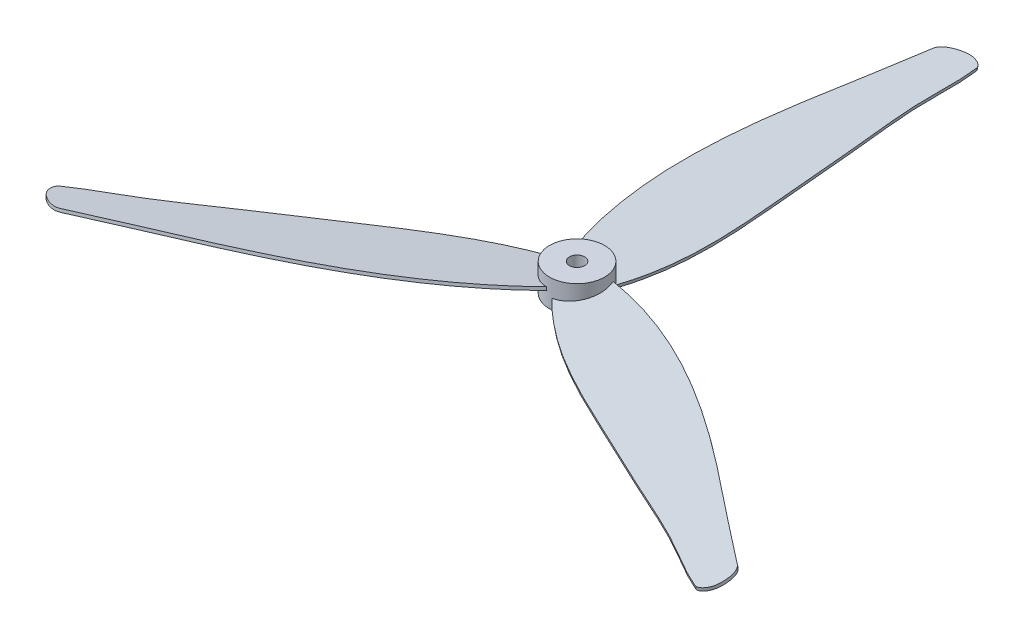
ISO-10303-21;
HEADER;
FILE_DESCRIPTION(('STEP AP214'),'2;1');
FILE_NAME('part.step','',(''),(''),'','','');
FILE_SCHEMA(('AUTOMOTIVE_DESIGN { 1 0 10303 214 1 1 1 1 }'));
ENDSEC;
DATA;
#1=APPLICATION_CONTEXT('core data for automotive mechanical design processes');
#2=APPLICATION_PROTOCOL_DEFINITION('international standard','automotive_design',2000,#1);
#3=PRODUCT_CONTEXT('',#1,'mechanical');
#4=PRODUCT('Part','Part','',(#3));
#5=PRODUCT_RELATED_PRODUCT_CATEGORY('part','',(#4));
#6=PRODUCT_DEFINITION_FORMATION('','',#4);
#7=PRODUCT_DEFINITION_CONTEXT('part definition',#1,'design');
#8=PRODUCT_DEFINITION('design','',#6,#7);
#9=PRODUCT_DEFINITION_SHAPE('','',#8);
#10=(LENGTH_UNIT() NAMED_UNIT(*) SI_UNIT(.MILLI.,.METRE.));
#11=(NAMED_UNIT(*) PLANE_ANGLE_UNIT() SI_UNIT($,.RADIAN.));
#12=(NAMED_UNIT(*) SI_UNIT($,.STERADIAN.) SOLID_ANGLE_UNIT());
#13=UNCERTAINTY_MEASURE_WITH_UNIT(LENGTH_MEASURE(1.E-05),#10,'distance_accuracy_value','');
#14=(GEOMETRIC_REPRESENTATION_CONTEXT(3) GLOBAL_UNCERTAINTY_ASSIGNED_CONTEXT((#13)) GLOBAL_UNIT_ASSIGNED_CONTEXT((#10,
#11,#12)) REPRESENTATION_CONTEXT('',''));
#15=CARTESIAN_POINT('',(0.,0.,0.));
#16=DIRECTION('',(0.,0.,1.));
#17=DIRECTION('',(1.,0.,0.));
#18=AXIS2_PLACEMENT_3D('',#15,#16,#17);
#19=CARTESIAN_POINT('',(0.,9.,0.));
#20=DIRECTION('',(0.,-1.,0.));
#21=DIRECTION('',(0.,0.,-1.));
#22=AXIS2_PLACEMENT_3D('',#19,#20,#21);
#23=CYLINDRICAL_SURFACE('',#22,9.);
#24=CARTESIAN_POINT('',(0.,3.54362794025801,0.));
#25=DIRECTION('',(0.156434465040231,0.987688340595138,0.));
#26=DIRECTION('',(0.987688340595138,-0.156434465040231,0.));
#27=AXIS2_PLACEMENT_3D('',#24,#25,#26);
#28=ELLIPSE('',#27,9.11218613209203,9.);
#29=CARTESIAN_POINT('',(7.30430784711758,2.38673922993417,-5.25804972157326));
#30=VERTEX_POINT('',#29);
#31=CARTESIAN_POINT('',(-7.28372938367546,4.69725734216683,-5.2865192958489));
#32=VERTEX_POINT('',#31);
#33=EDGE_CURVE('E97',#30,#32,#28,.T.);
#34=ORIENTED_EDGE('',*,*,#33,.F.);
#35=CARTESIAN_POINT('',(7.41620379576395,3.38148177852124,-5.09901179246494));
#36=CARTESIAN_POINT('',(7.39770465756707,3.21573761419823,-5.12591312980971));
#37=CARTESIAN_POINT('',(7.37913042608144,3.04997031965447,-5.15261695924113));
#38=CARTESIAN_POINT('',(7.34183177653266,2.71838947012545,-5.20562960227724));
#39=CARTESIAN_POINT('',(7.3231073584695,2.55257591514019,-5.23193841588193));
#40=CARTESIAN_POINT('',(7.30430784711759,2.38673922993417,-5.25804972157327));
#41=B_SPLINE_CURVE_WITH_KNOTS('',3,(#35,#36,#37,#38,#39,#40),.UNSPECIFIED.,.F.,.F.,(4,2,4),(0.,
0.506785983130427,1.01357196626085),.UNSPECIFIED.);
#42=CARTESIAN_POINT('',(7.41620379576395,3.38148177852124,-5.09901179246494));
#43=VERTEX_POINT('',#42);
#44=EDGE_CURVE('E164',#43,#30,#41,.T.);
#45=ORIENTED_EDGE('',*,*,#44,.F.);
#46=CARTESIAN_POINT('',(0.,4.55609306604602,0.));
#47=DIRECTION('',(0.156434465040231,0.987688340595138,0.));
#48=DIRECTION('',(0.987688340595138,-0.156434465040231,0.));
#49=AXIS2_PLACEMENT_3D('',#46,#47,#48);
#50=ELLIPSE('',#49,9.11218613209203,9.);
#51=CARTESIAN_POINT('',(-7.17614569150034,5.69268288508163,-5.43166024474664));
#52=VERTEX_POINT('',#51);
#53=EDGE_CURVE('E184',#43,#52,#50,.T.);
#54=ORIENTED_EDGE('',*,*,#53,.T.);
#55=CARTESIAN_POINT('',(-7.28372938367546,4.69725734216683,-5.28651929584885));
#56=CARTESIAN_POINT('',(-7.26593509251969,4.86312914673476,-5.31103307316615));
#57=CARTESIAN_POINT('',(-7.24807263926054,5.02901717759495,-5.33538504089962));
#58=CARTESIAN_POINT('',(-7.2122114085355,5.36082569189989,-5.38376535719889));
#59=CARTESIAN_POINT('',(-7.1942126310696,5.52674617534463,-5.40779370576468));
#60=CARTESIAN_POINT('',(-7.17614569150033,5.69268288508163,-5.43166024474664));
#61=B_SPLINE_CURVE_WITH_KNOTS('',3,(#55,#56,#57,#58,#59,#60),.UNSPECIFIED.,.F.,.F.,(4,2,4),(0.,
0.505844164901021,1.01168832980204),.UNSPECIFIED.);
#62=EDGE_CURVE('E171',#32,#52,#61,.T.);
#63=ORIENTED_EDGE('',*,*,#62,.F.);
#64=EDGE_LOOP('',(#34,#45,#54,#63));
#65=FACE_BOUND('',#64,.T.);
#66=CARTESIAN_POINT('',(0.,0.,0.));
#67=DIRECTION('',(0.,1.,0.));
#68=DIRECTION('',(0.,0.,1.));
#69=AXIS2_PLACEMENT_3D('',#66,#67,#68);
#70=CIRCLE('',#69,9.);
#71=CARTESIAN_POINT('',(0.,0.,9.));
#72=VERTEX_POINT('',#71);
#73=EDGE_CURVE('E230',#72,#72,#70,.T.);
#74=ORIENTED_EDGE('',*,*,#73,.T.);
#75=EDGE_LOOP('',(#74));
#76=FACE_BOUND('',#75,.T.);
#77=CARTESIAN_POINT('',(0.,9.,0.));
#78=DIRECTION('',(0.,1.,0.));
#79=DIRECTION('',(0.,0.,1.));
#80=AXIS2_PLACEMENT_3D('',#77,#78,#79);
#81=CIRCLE('',#80,9.);
#82=CARTESIAN_POINT('',(0.,9.,9.));
#83=VERTEX_POINT('',#82);
#84=EDGE_CURVE('E233',#83,#83,#81,.T.);
#85=ORIENTED_EDGE('',*,*,#84,.F.);
#86=EDGE_LOOP('',(#85));
#87=FACE_BOUND('',#86,.T.);
#88=CARTESIAN_POINT('',(0.,3.54362794025801,0.));
#89=DIRECTION('',(-0.0782172325201163,0.987688340595138,0.135476220752269));
#90=DIRECTION('',(-0.493844170297573,-0.156434465040231,0.855363193977084));
#91=AXIS2_PLACEMENT_3D('',#88,#89,#90);
#92=ELLIPSE('',#91,9.11218613209203,9.);
#93=CARTESIAN_POINT('',(0.901450709685308,2.38673922993417,8.95474101345248));
#94=VERTEX_POINT('',#93);
#95=CARTESIAN_POINT('',(8.22012469963952,4.69725734216683,-3.66463503262963));
#96=VERTEX_POINT('',#95);
#97=EDGE_CURVE('E185',#94,#96,#92,.T.);
#98=ORIENTED_EDGE('',*,*,#97,.F.);
#99=CARTESIAN_POINT('',(0.707771848589028,3.38148177852124,8.97212678300662));
#100=CARTESIAN_POINT('',(0.740318659223825,3.21573761419823,8.9695567280524));
#101=CARTESIAN_POINT('',(0.77273196963258,3.04997031965448,8.96682288644578));
#102=CARTESIAN_POINT('',(0.837291589998006,2.71838947012545,8.96102762992774));
#103=CARTESIAN_POINT('',(0.869437899954678,2.55257591514019,8.95796621501631));
#104=CARTESIAN_POINT('',(0.901450709685308,2.38673922993417,8.95474101345248));
#105=B_SPLINE_CURVE_WITH_KNOTS('',3,(#99,#100,#101,#102,#103,#104),.UNSPECIFIED.,.F.,.F.,(4,2,
4),(0.,0.506785983130426,1.01357196626085),.UNSPECIFIED.);
#106=CARTESIAN_POINT('',(0.707771848589048,3.38148177852124,8.97212678300663));
#107=VERTEX_POINT('',#106);
#108=EDGE_CURVE('E196',#107,#94,#105,.T.);
#109=ORIENTED_EDGE('',*,*,#108,.F.);
#110=CARTESIAN_POINT('',(0.,4.55609306604602,0.));
#111=DIRECTION('',(-0.0782172325201163,0.987688340595138,0.135476220752269));
#112=DIRECTION('',(-0.493844170297573,-0.156434465040231,0.855363193977084));
#113=AXIS2_PLACEMENT_3D('',#110,#111,#112);
#114=ELLIPSE('',#113,9.11218613209203,9.);
#115=CARTESIAN_POINT('',(8.29202860242678,5.69268288508163,-3.49889434772418));
#116=VERTEX_POINT('',#115);
#117=EDGE_CURVE('E236',#107,#116,#114,.T.);
#118=ORIENTED_EDGE('',*,*,#117,.T.);
#119=CARTESIAN_POINT('',(8.22012469963947,4.69725734216683,-3.66463503262966));
#120=CARTESIAN_POINT('',(8.23245710796109,4.86312914673476,-3.63696783578777));
#121=CARTESIAN_POINT('',(8.24461530402083,5.02901717759496,-3.6093225136247));
#122=CARTESIAN_POINT('',(8.2685832716166,5.36082569189989,-3.55407561865621));
#123=CARTESIAN_POINT('',(8.28039304315262,5.52674617534463,-3.52647404585078));
#124=CARTESIAN_POINT('',(8.29202860242678,5.69268288508163,-3.49889434772418));
#125=B_SPLINE_CURVE_WITH_KNOTS('',3,(#119,#120,#121,#122,#123,#124),.UNSPECIFIED.,.F.,.F.,(4,2,
4),(0.,0.505844164901022,1.01168832980204),.UNSPECIFIED.);
#126=EDGE_CURVE('E186',#96,#116,#125,.T.);
#127=ORIENTED_EDGE('',*,*,#126,.F.);
#128=EDGE_LOOP('',(#98,#109,#118,#127));
#129=FACE_BOUND('',#128,.T.);
#130=CARTESIAN_POINT('',(0.,3.54362794025801,0.));
#131=DIRECTION('',(-0.0782172325201162,0.987688340595138,-0.135476220752269));
#132=DIRECTION('',(-0.493844170297573,-0.156434465040231,-0.855363193977084));
#133=AXIS2_PLACEMENT_3D('',#130,#131,#132);
#134=ELLIPSE('',#133,9.11218613209203,9.);
#135=CARTESIAN_POINT('',(-8.20575855680295,2.38673922993417,-3.69669129187918));
#136=VERTEX_POINT('',#135);
#137=CARTESIAN_POINT('',(-0.936395315964,4.69725734216683,8.95115432847857));
#138=VERTEX_POINT('',#137);
#139=EDGE_CURVE('E11',#136,#138,#134,.T.);
#140=ORIENTED_EDGE('',*,*,#139,.F.);
#141=CARTESIAN_POINT('',(-8.12397564435305,3.38148177852123,-3.87311499054165));
#142=CARTESIAN_POINT('',(-8.13802331679097,3.21573761419823,-3.84364359824265));
#143=CARTESIAN_POINT('',(-8.15186239571408,3.04997031965447,-3.81420592720461));
#144=CARTESIAN_POINT('',(-8.17912336653072,2.71838947012545,-3.75539802765046));
#145=CARTESIAN_POINT('',(-8.19254525842424,2.55257591514019,-3.72602779913434));
#146=CARTESIAN_POINT('',(-8.20575855680295,2.38673922993418,-3.69669129187918));
#147=B_SPLINE_CURVE_WITH_KNOTS('',3,(#141,#142,#143,#144,#145,#146),.UNSPECIFIED.,.F.,.F.,(4,2,
4),(0.,0.50678598313042,1.01357196626084),.UNSPECIFIED.);
#148=CARTESIAN_POINT('',(-8.12397564435306,3.38148177852124,-3.87311499054165));
#149=VERTEX_POINT('',#148);
#150=EDGE_CURVE('E96',#149,#136,#147,.T.);
#151=ORIENTED_EDGE('',*,*,#150,.F.);
#152=CARTESIAN_POINT('',(0.,4.55609306604602,0.));
#153=DIRECTION('',(-0.0782172325201162,0.987688340595138,-0.135476220752269));
#154=DIRECTION('',(-0.493844170297573,-0.156434465040231,-0.855363193977084));
#155=AXIS2_PLACEMENT_3D('',#152,#153,#154);
#156=ELLIPSE('',#155,9.11218613209203,9.);
#157=CARTESIAN_POINT('',(-1.11588291092639,5.69268288508163,8.93055459247086));
#158=VERTEX_POINT('',#157);
#159=EDGE_CURVE('E91',#149,#158,#156,.T.);
#160=ORIENTED_EDGE('',*,*,#159,.T.);
#161=CARTESIAN_POINT('',(-0.936395315963954,4.69725734216683,8.95115432847855));
#162=CARTESIAN_POINT('',(-0.966522015441339,4.86312914673476,8.94800090895396));
#163=CARTESIAN_POINT('',(-0.996542664760233,5.02901717759495,8.94470755452437));
#164=CARTESIAN_POINT('',(-1.05637186308104,5.36082569189988,8.93784097585514));
#165=CARTESIAN_POINT('',(-1.08618041208296,5.52674617534462,8.93426775161551));
#166=CARTESIAN_POINT('',(-1.11588291092638,5.69268288508162,8.93055459247086));
#167=B_SPLINE_CURVE_WITH_KNOTS('',3,(#161,#162,#163,#164,#165,#166),.UNSPECIFIED.,.F.,.F.,(4,2,
4),(0.,0.505844164901016,1.01168832980203),.UNSPECIFIED.);
#168=EDGE_CURVE('E49',#138,#158,#167,.T.);
#169=ORIENTED_EDGE('',*,*,#168,.F.);
#170=EDGE_LOOP('',(#140,#151,#160,#169));
#171=FACE_BOUND('',#170,.T.);
#172=ADVANCED_FACE('F41',(#65,#76,#87,#129,#171),#23,.T.);
#173=CARTESIAN_POINT('',(0.,9.,0.));
#174=DIRECTION('',(0.,1.,0.));
#175=DIRECTION('',(0.,0.,1.));
#176=AXIS2_PLACEMENT_3D('',#173,#174,#175);
#177=PLANE('',#176);
#178=ORIENTED_EDGE('',*,*,#84,.T.);
#179=EDGE_LOOP('',(#178));
#180=FACE_BOUND('',#179,.T.);
#181=CARTESIAN_POINT('',(0.,9.,0.));
#182=DIRECTION('',(0.,1.,0.));
#183=DIRECTION('',(0.,0.,1.));
#184=AXIS2_PLACEMENT_3D('',#181,#182,#183);
#185=CIRCLE('',#184,2.5);
#186=CARTESIAN_POINT('',(0.,9.,2.5));
#187=VERTEX_POINT('',#186);
#188=EDGE_CURVE('E224',#187,#187,#185,.T.);
#189=ORIENTED_EDGE('',*,*,#188,.F.);
#190=EDGE_LOOP('',(#189));
#191=FACE_BOUND('',#190,.T.);
#192=ADVANCED_FACE('F246',(#180,#191),#177,.T.);
#193=CARTESIAN_POINT('',(0.,0.,0.));
#194=DIRECTION('',(0.,1.,0.));
#195=DIRECTION('',(0.,0.,1.));
#196=AXIS2_PLACEMENT_3D('',#193,#194,#195);
#197=PLANE('',#196);
#198=ORIENTED_EDGE('',*,*,#73,.F.);
#199=EDGE_LOOP('',(#198));
#200=FACE_BOUND('',#199,.T.);
#201=CARTESIAN_POINT('',(0.,0.,0.));
#202=DIRECTION('',(0.,1.,0.));
#203=DIRECTION('',(0.,0.,1.));
#204=AXIS2_PLACEMENT_3D('',#201,#202,#203);
#205=CIRCLE('',#204,2.5);
#206=CARTESIAN_POINT('',(0.,0.,2.5));
#207=VERTEX_POINT('',#206);
#208=EDGE_CURVE('E216',#207,#207,#205,.T.);
#209=ORIENTED_EDGE('',*,*,#208,.T.);
#210=EDGE_LOOP('',(#209));
#211=FACE_BOUND('',#210,.T.);
#212=ADVANCED_FACE('F251',(#200,#211),#197,.F.);
#213=CARTESIAN_POINT('',(0.,9.,0.));
#214=DIRECTION('',(0.,-1.,0.));
#215=DIRECTION('',(0.,0.,-1.));
#216=AXIS2_PLACEMENT_3D('',#213,#214,#215);
#217=CYLINDRICAL_SURFACE('',#216,2.5);
#218=ORIENTED_EDGE('',*,*,#188,.T.);
#219=EDGE_LOOP('',(#218));
#220=FACE_BOUND('',#219,.T.);
#221=ORIENTED_EDGE('',*,*,#208,.F.);
#222=EDGE_LOOP('',(#221));
#223=FACE_BOUND('',#222,.T.);
#224=ADVANCED_FACE('F206',(#220,#223),#217,.F.);
#225=CARTESIAN_POINT('',(6.07128886437522,4.58317983054747,-4.07358476355836));
#226=CARTESIAN_POINT('',(30.0274191154173,5.88967505732956,0.232500129810801));
#227=CARTESIAN_POINT('',(65.3611569346111,5.90057996757105,20.5529410073428));
#228=CARTESIAN_POINT('',(95.6678257611402,4.77268380270435,46.2734226874995));
#229=CARTESIAN_POINT('',(110.338679272948,4.43565398162164,57.2007572182211));
#230=CARTESIAN_POINT('',(110.888971991819,3.8453898245611,61.8217851437842));
#231=CARTESIAN_POINT('',(109.606010039389,3.14844611510895,66.1621294437965));
#232=CARTESIAN_POINT('',(106.812806514418,2.73477342422366,67.5653501932813));
#233=CARTESIAN_POINT('',(105.316603334889,2.7101153798658,66.8812861666804));
#234=CARTESIAN_POINT('',(99.7791919174203,2.61715864183006,64.3619605745815));
#235=CARTESIAN_POINT('',(88.5197573784138,2.72077298483617,57.1059234454856));
#236=CARTESIAN_POINT('',(70.2021946473294,2.3700309638207,49.0873556658917));
#237=CARTESIAN_POINT('',(39.3058016566439,2.0131199885944,33.8513715628341));
#238=CARTESIAN_POINT('',(14.3923305409287,1.52115674879017,23.0542265062131));
#239=CARTESIAN_POINT('',(0.244924495635226,2.42772974256338,8.27685441144336));
#240=B_SPLINE_CURVE_WITH_KNOTS('',3,(#225,#226,#227,#228,#229,#230,#231,#232,#233,#234,#235,
#236,#237,#238,#239),.UNSPECIFIED.,.F.,.F.,(4,1,1,1,1,1,1,1,1,1,1,1,4),(0.,0.28293344669307,
0.466482550178483,0.471857061893158,0.495005991949986,0.514382548074224,0.523354602147642,
0.526650828201052,0.53318720122455,0.595375397845292,0.68247325334402,0.76793576336452,1.),.UNSPECIFIED.);
#241=DIRECTION('',(-0.0782172325201162,0.987688340595138,0.135476220752268));
#242=VECTOR('',#241,1.);
#243=SURFACE_OF_LINEAR_EXTRUSION('',#240,#242);
#244=EDGE_CURVE('E210',#96,#94,#240,.T.);
#245=ORIENTED_EDGE('',*,*,#244,.F.);
#246=ORIENTED_EDGE('',*,*,#126,.T.);
#247=CARTESIAN_POINT('',(5.9930716318551,5.57086817114261,-3.93810854280609));
#248=CARTESIAN_POINT('',(29.9492018828972,6.8773633979247,0.367976350563069));
#249=CARTESIAN_POINT('',(65.2829397020909,6.88826830816618,20.6884172280951));
#250=CARTESIAN_POINT('',(95.58960852862,5.76037214329949,46.4088989082518));
#251=CARTESIAN_POINT('',(110.260462040428,5.42334232221677,57.3362334389734));
#252=CARTESIAN_POINT('',(110.810754759299,4.83307816515624,61.9572613645364));
#253=CARTESIAN_POINT('',(109.527792806869,4.13613445570409,66.2976056645488));
#254=CARTESIAN_POINT('',(106.734589281898,3.7224617648188,67.7008264140335));
#255=CARTESIAN_POINT('',(105.238386102369,3.69780372046094,67.0167623874327));
#256=CARTESIAN_POINT('',(99.7009746849001,3.6048469824252,64.4974367953338));
#257=CARTESIAN_POINT('',(88.4415401458937,3.70846132543131,57.2413996662378));
#258=CARTESIAN_POINT('',(70.1239774148093,3.35771930441584,49.222831886644));
#259=CARTESIAN_POINT('',(39.2275844241237,3.00080832918954,33.9868477835864));
#260=CARTESIAN_POINT('',(14.3141133084086,2.50884508938531,23.1897027269654));
#261=CARTESIAN_POINT('',(0.16670726311511,3.41541808315852,8.41233063219563));
#262=B_SPLINE_CURVE_WITH_KNOTS('',3,(#247,#248,#249,#250,#251,#252,#253,#254,#255,#256,#257,
#258,#259,#260,#261),.UNSPECIFIED.,.F.,.F.,(4,1,1,1,1,1,1,1,1,1,1,1,4),(0.,0.28293344669307,
0.466482550178483,0.471857061893158,0.495005991949986,0.514382548074224,0.523354602147642,
0.526650828201052,0.53318720122455,0.595375397845292,0.68247325334402,0.76793576336452,1.),.UNSPECIFIED.);
#263=EDGE_CURVE('E146',#116,#107,#262,.T.);
#264=ORIENTED_EDGE('',*,*,#263,.T.);
#265=ORIENTED_EDGE('',*,*,#108,.T.);
#266=EDGE_LOOP('',(#245,#246,#264,#265));
#267=FACE_BOUND('',#266,.T.);
#268=ADVANCED_FACE('F202',(#267),#243,.F.);
#269=CARTESIAN_POINT('',(110.275945295483,3.5873097675363,63.3493846772373));
#270=DIRECTION('',(-0.0782172325201163,0.987688340595138,0.135476220752269));
#271=DIRECTION('',(0.,-0.135892549420804,0.9907235815362));
#272=AXIS2_PLACEMENT_3D('',#269,#270,#271);
#273=PLANE('',#272);
#274=ORIENTED_EDGE('',*,*,#244,.T.);
#275=ORIENTED_EDGE('',*,*,#97,.T.);
#276=EDGE_LOOP('',(#274,#275));
#277=FACE_BOUND('',#276,.T.);
#278=ADVANCED_FACE('F160',(#277),#273,.F.);
#279=CARTESIAN_POINT('',(110.197728062963,4.57499810813144,63.4848608979895));
#280=DIRECTION('',(-0.0782172325201163,0.987688340595138,0.135476220752269));
#281=DIRECTION('',(0.,-0.135892549420804,0.9907235815362));
#282=AXIS2_PLACEMENT_3D('',#279,#280,#281);
#283=PLANE('',#282);
#284=ORIENTED_EDGE('',*,*,#117,.F.);
#285=ORIENTED_EDGE('',*,*,#263,.F.);
#286=EDGE_LOOP('',(#284,#285));
#287=FACE_BOUND('',#286,.T.);
#288=ADVANCED_FACE('F158',(#287),#283,.T.);
#289=CARTESIAN_POINT('',(-6.56347232189839,4.58317983054747,-3.22109800848331));
#290=CARTESIAN_POINT('',(-14.8123585389095,5.88967505732956,-26.1207578289392));
#291=CARTESIAN_POINT('',(-14.8812094324641,5.90057996757105,-66.8808928297859));
#292=CARTESIAN_POINT('',(-7.75995331314078,4.77268380270435,-105.98747877772));
#293=CARTESIAN_POINT('',(-5.63203076978911,4.43565398162164,-124.156477879507));
#294=CARTESIAN_POINT('',(-1.90524955408981,3.8453898245611,-126.943559316349));
#295=CARTESIAN_POINT('',(2.49507984710695,3.14844611510895,-128.002653823462));
#296=CARTESIAN_POINT('',(5.10690642576363,2.73477342422366,-126.285278987639));
#297=CARTESIAN_POINT('',(5.26259119067698,2.7101153798658,-124.647497011643));
#298=CARTESIAN_POINT('',(5.84949693624938,2.61715864183006,-118.59229525686));
#299=CARTESIAN_POINT('',(5.1953017211525,2.72077298483617,-105.213320349284));
#300=CARTESIAN_POINT('',(7.4097996875991,2.3700309638207,-85.3405617989531));
#301=CARTESIAN_POINT('',(9.66324689803829,2.0131199885944,-50.9655085321832));
#302=CARTESIAN_POINT('',(12.7693805485167,1.52115674879017,-23.9912371212135));
#303=CARTESIAN_POINT('',(7.04550393591762,2.42772974256338,-4.35053804095091));
#304=B_SPLINE_CURVE_WITH_KNOTS('',3,(#289,#290,#291,#292,#293,#294,#295,#296,#297,#298,#299,
#300,#301,#302,#303),.UNSPECIFIED.,.F.,.F.,(4,1,1,1,1,1,1,1,1,1,1,1,4),(0.,0.28293344669307,
0.466482550178483,0.471857061893158,0.495005991949986,0.514382548074224,0.523354602147642,
0.526650828201052,0.53318720122455,0.595375397845292,0.68247325334402,0.76793576336452,1.),.UNSPECIFIED.);
#305=DIRECTION('',(0.156434465040231,0.987688340595138,0.));
#306=VECTOR('',#305,1.);
#307=SURFACE_OF_LINEAR_EXTRUSION('',#304,#306);
#308=EDGE_CURVE('E137',#32,#30,#304,.T.);
#309=ORIENTED_EDGE('',*,*,#308,.F.);
#310=ORIENTED_EDGE('',*,*,#62,.T.);
#311=CARTESIAN_POINT('',(-6.40703785685816,5.57086817114261,-3.22109800848331));
#312=CARTESIAN_POINT('',(-14.6559240738692,6.8773633979247,-26.1207578289392));
#313=CARTESIAN_POINT('',(-14.7247749674238,6.88826830816618,-66.8808928297859));
#314=CARTESIAN_POINT('',(-7.60351884810055,5.76037214329949,-105.98747877772));
#315=CARTESIAN_POINT('',(-5.47559630474888,5.42334232221677,-124.156477879507));
#316=CARTESIAN_POINT('',(-1.74881508904958,4.83307816515624,-126.943559316349));
#317=CARTESIAN_POINT('',(2.65151431214718,4.13613445570409,-128.002653823462));
#318=CARTESIAN_POINT('',(5.26334089080386,3.7224617648188,-126.285278987639));
#319=CARTESIAN_POINT('',(5.41902565571722,3.69780372046094,-124.647497011643));
#320=CARTESIAN_POINT('',(6.00593140128962,3.6048469824252,-118.59229525686));
#321=CARTESIAN_POINT('',(5.35173618619274,3.70846132543131,-105.213320349284));
#322=CARTESIAN_POINT('',(7.56623415263933,3.35771930441584,-85.3405617989531));
#323=CARTESIAN_POINT('',(9.81968136307852,3.00080832918954,-50.9655085321832));
#324=CARTESIAN_POINT('',(12.9258150135569,2.50884508938531,-23.9912371212135));
#325=CARTESIAN_POINT('',(7.20193840095785,3.41541808315852,-4.35053804095091));
#326=B_SPLINE_CURVE_WITH_KNOTS('',3,(#311,#312,#313,#314,#315,#316,#317,#318,#319,#320,#321,
#322,#323,#324,#325),.UNSPECIFIED.,.F.,.F.,(4,1,1,1,1,1,1,1,1,1,1,1,4),(0.,0.28293344669307,
0.466482550178483,0.471857061893158,0.495005991949986,0.514382548074224,0.523354602147642,
0.526650828201052,0.53318720122455,0.595375397845292,0.68247325334402,0.76793576336452,1.),.UNSPECIFIED.);
#327=EDGE_CURVE('E62',#52,#43,#326,.T.);
#328=ORIENTED_EDGE('',*,*,#327,.T.);
#329=ORIENTED_EDGE('',*,*,#44,.T.);
#330=EDGE_LOOP('',(#309,#310,#328,#329));
#331=FACE_BOUND('',#330,.T.);
#332=ADVANCED_FACE('F154',(#331),#307,.F.);
#333=CARTESIAN_POINT('',(-0.275796203142048,3.5873097675363,-127.17646239085));
#334=DIRECTION('',(0.156434465040231,0.987688340595138,0.));
#335=DIRECTION('',(0.85799178973865,-0.135892549420804,-0.495361790768104));
#336=AXIS2_PLACEMENT_3D('',#333,#334,#335);
#337=PLANE('',#336);
#338=ORIENTED_EDGE('',*,*,#308,.T.);
#339=ORIENTED_EDGE('',*,*,#33,.T.);
#340=EDGE_LOOP('',(#338,#339));
#341=FACE_BOUND('',#340,.T.);
#342=ADVANCED_FACE('F125',(#341),#337,.F.);
#343=CARTESIAN_POINT('',(-0.119361738101816,4.57499810813144,-127.17646239085));
#344=DIRECTION('',(0.156434465040231,0.987688340595138,0.));
#345=DIRECTION('',(0.85799178973865,-0.135892549420804,-0.495361790768104));
#346=AXIS2_PLACEMENT_3D('',#343,#344,#345);
#347=PLANE('',#346);
#348=ORIENTED_EDGE('',*,*,#53,.F.);
#349=ORIENTED_EDGE('',*,*,#327,.F.);
#350=EDGE_LOOP('',(#348,#349));
#351=FACE_BOUND('',#350,.T.);
#352=ADVANCED_FACE('F123',(#351),#347,.T.);
#353=CARTESIAN_POINT('',(0.492183457523219,4.58317983054747,7.29468277204169));
#354=CARTESIAN_POINT('',(-15.2150605765078,5.88967505732956,25.8882576991286));
#355=CARTESIAN_POINT('',(-50.4799475021469,5.90057996757105,46.3279518224437));
#356=CARTESIAN_POINT('',(-87.9078724479993,4.77268380270435,59.7140560902217));
#357=CARTESIAN_POINT('',(-104.706648503159,4.43565398162164,66.9557206612871));
#358=CARTESIAN_POINT('',(-108.98372243773,3.8453898245611,65.1217741725657));
#359=CARTESIAN_POINT('',(-112.101089886496,3.14844611510895,61.8405243796661));
#360=CARTESIAN_POINT('',(-111.919712940182,2.73477342422366,58.7199287943587));
#361=CARTESIAN_POINT('',(-110.579194525566,2.7101153798658,57.7662108449635));
#362=CARTESIAN_POINT('',(-105.62868885367,2.61715864183006,54.2303346822791));
#363=CARTESIAN_POINT('',(-93.7150590995663,2.72077298483617,48.1073969037994));
#364=CARTESIAN_POINT('',(-77.6119943349286,2.3700309638207,36.2532061330621));
#365=CARTESIAN_POINT('',(-48.9690485546822,2.0131199885944,17.1141369693495));
#366=CARTESIAN_POINT('',(-27.1617110894455,1.52115674879017,0.93701061500056));
#367=CARTESIAN_POINT('',(-7.2904284315529,2.42772974256338,-3.92631637049242));
#368=B_SPLINE_CURVE_WITH_KNOTS('',3,(#353,#354,#355,#356,#357,#358,#359,#360,#361,#362,#363,
#364,#365,#366,#367),.UNSPECIFIED.,.F.,.F.,(4,1,1,1,1,1,1,1,1,1,1,1,4),(0.,0.28293344669307,
0.466482550178483,0.471857061893158,0.495005991949986,0.514382548074224,0.523354602147642,
0.526650828201052,0.53318720122455,0.595375397845292,0.68247325334402,0.76793576336452,1.),.UNSPECIFIED.);
#369=DIRECTION('',(-0.0782172325201162,0.987688340595138,-0.135476220752268));
#370=VECTOR('',#369,1.);
#371=SURFACE_OF_LINEAR_EXTRUSION('',#368,#370);
#372=EDGE_CURVE('E103',#138,#136,#368,.T.);
#373=ORIENTED_EDGE('',*,*,#372,.F.);
#374=ORIENTED_EDGE('',*,*,#168,.T.);
#375=CARTESIAN_POINT('',(0.413966225003103,5.57086817114261,7.15920655128942));
#376=CARTESIAN_POINT('',(-15.2932778090279,6.8773633979247,25.7527814783764));
#377=CARTESIAN_POINT('',(-50.558164734667,6.88826830816618,46.1924756016914));
#378=CARTESIAN_POINT('',(-87.9860896805194,5.76037214329949,59.5785798694695));
#379=CARTESIAN_POINT('',(-104.784865735679,5.42334232221677,66.8202444405348));
#380=CARTESIAN_POINT('',(-109.06193967025,4.83307816515624,64.9862979518134));
#381=CARTESIAN_POINT('',(-112.179307119016,4.13613445570409,61.7050481589139));
#382=CARTESIAN_POINT('',(-111.997930172702,3.7224617648188,58.5844525736064));
#383=CARTESIAN_POINT('',(-110.657411758086,3.69780372046094,57.6307346242112));
#384=CARTESIAN_POINT('',(-105.70690608619,3.6048469824252,54.0948584615268));
#385=CARTESIAN_POINT('',(-93.7932763320864,3.70846132543131,47.9719206830471));
#386=CARTESIAN_POINT('',(-77.6902115674487,3.35771930441584,36.1177299123098));
#387=CARTESIAN_POINT('',(-49.0472657872023,3.00080832918954,16.9786607485972));
#388=CARTESIAN_POINT('',(-27.2399283219656,2.50884508938531,0.801534394248291));
#389=CARTESIAN_POINT('',(-7.36864566407302,3.41541808315852,-4.06179259124468));
#390=B_SPLINE_CURVE_WITH_KNOTS('',3,(#375,#376,#377,#378,#379,#380,#381,#382,#383,#384,#385,
#386,#387,#388,#389),.UNSPECIFIED.,.F.,.F.,(4,1,1,1,1,1,1,1,1,1,1,1,4),(0.,0.28293344669307,
0.466482550178483,0.471857061893158,0.495005991949986,0.514382548074224,0.523354602147642,
0.526650828201052,0.53318720122455,0.595375397845292,0.68247325334402,0.76793576336452,1.),.UNSPECIFIED.);
#391=EDGE_CURVE('E55',#158,#149,#390,.T.);
#392=ORIENTED_EDGE('',*,*,#391,.T.);
#393=ORIENTED_EDGE('',*,*,#150,.T.);
#394=EDGE_LOOP('',(#373,#374,#392,#393));
#395=FACE_BOUND('',#394,.T.);
#396=ADVANCED_FACE('F101',(#395),#371,.F.);
#397=CARTESIAN_POINT('',(-110.000149092341,3.5873097675363,63.8270777136139));
#398=DIRECTION('',(-0.0782172325201162,0.987688340595138,-0.135476220752269));
#399=DIRECTION('',(-0.857991789738657,-0.135892549420804,-0.495361790768092));
#400=AXIS2_PLACEMENT_3D('',#397,#398,#399);
#401=PLANE('',#400);
#402=ORIENTED_EDGE('',*,*,#372,.T.);
#403=ORIENTED_EDGE('',*,*,#139,.T.);
#404=EDGE_LOOP('',(#402,#403));
#405=FACE_BOUND('',#404,.T.);
#406=ADVANCED_FACE('F122',(#405),#401,.F.);
#407=CARTESIAN_POINT('',(-110.078366324861,4.57499810813144,63.6916014928616));
#408=DIRECTION('',(-0.0782172325201162,0.987688340595138,-0.135476220752269));
#409=DIRECTION('',(-0.857991789738657,-0.135892549420804,-0.495361790768092));
#410=AXIS2_PLACEMENT_3D('',#407,#408,#409);
#411=PLANE('',#410);
#412=ORIENTED_EDGE('',*,*,#159,.F.);
#413=ORIENTED_EDGE('',*,*,#391,.F.);
#414=EDGE_LOOP('',(#412,#413));
#415=FACE_BOUND('',#414,.T.);
#416=ADVANCED_FACE('F92',(#415),#411,.T.);
#417=CLOSED_SHELL('',(#172,#192,#212,#224,#268,#278,#288,#332,#342,#352,#396,#406,#416));
#418=MANIFOLD_SOLID_BREP('B2',#417);
#419=ADVANCED_BREP_SHAPE_REPRESENTATION('',(#18,#418),#14);
#420=SHAPE_DEFINITION_REPRESENTATION(#9,#419);
ENDSEC;
END-ISO-10303-21;
